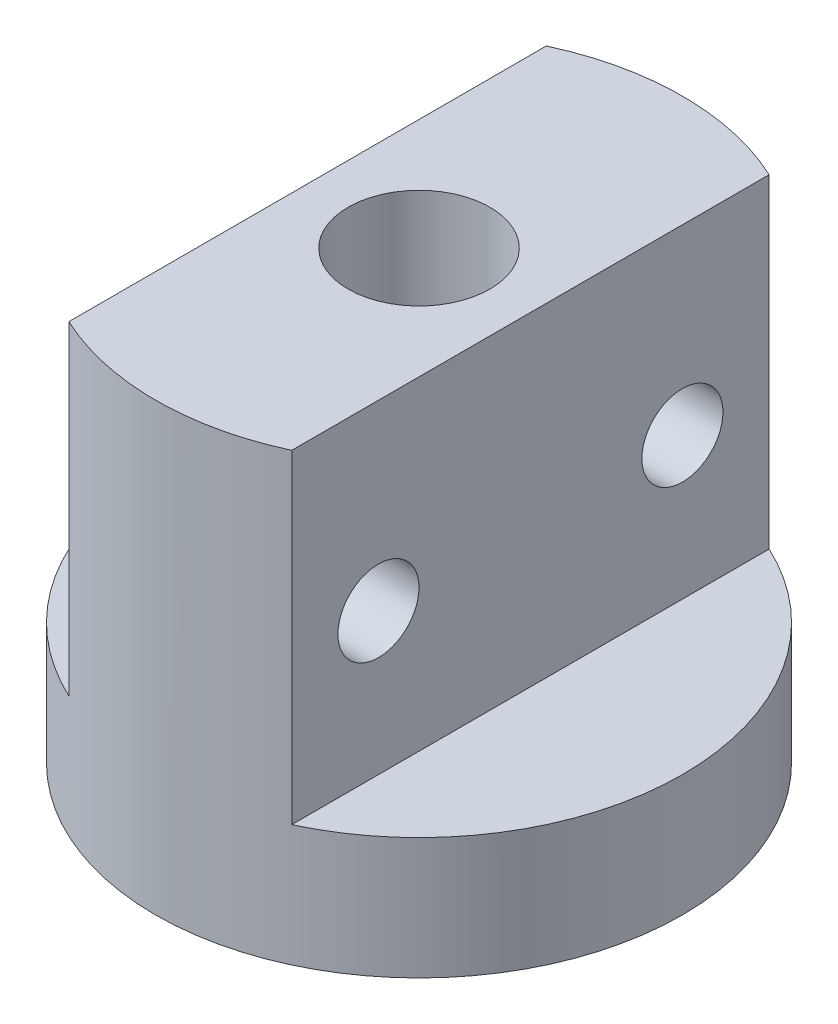
ISO-10303-21;
HEADER;
FILE_DESCRIPTION(('STEP AP214'),'2;1');
FILE_NAME('part.step','',(''),(''),'','','');
FILE_SCHEMA(('AUTOMOTIVE_DESIGN { 1 0 10303 214 1 1 1 1 }'));
ENDSEC;
DATA;
#1=APPLICATION_CONTEXT('core data for automotive mechanical design processes');
#2=APPLICATION_PROTOCOL_DEFINITION('international standard','automotive_design',2000,#1);
#3=PRODUCT_CONTEXT('',#1,'mechanical');
#4=PRODUCT('Part','Part','',(#3));
#5=PRODUCT_RELATED_PRODUCT_CATEGORY('part','',(#4));
#6=PRODUCT_DEFINITION_FORMATION('','',#4);
#7=PRODUCT_DEFINITION_CONTEXT('part definition',#1,'design');
#8=PRODUCT_DEFINITION('design','',#6,#7);
#9=PRODUCT_DEFINITION_SHAPE('','',#8);
#10=(LENGTH_UNIT() NAMED_UNIT(*) SI_UNIT(.MILLI.,.METRE.));
#11=(NAMED_UNIT(*) PLANE_ANGLE_UNIT() SI_UNIT($,.RADIAN.));
#12=(NAMED_UNIT(*) SI_UNIT($,.STERADIAN.) SOLID_ANGLE_UNIT());
#13=UNCERTAINTY_MEASURE_WITH_UNIT(LENGTH_MEASURE(1.E-05),#10,'distance_accuracy_value','');
#14=(GEOMETRIC_REPRESENTATION_CONTEXT(3) GLOBAL_UNCERTAINTY_ASSIGNED_CONTEXT((#13)) GLOBAL_UNIT_ASSIGNED_CONTEXT((#10,
#11,#12)) REPRESENTATION_CONTEXT('',''));
#15=CARTESIAN_POINT('',(0.,0.,0.));
#16=DIRECTION('',(0.,0.,1.));
#17=DIRECTION('',(1.,0.,0.));
#18=AXIS2_PLACEMENT_3D('',#15,#16,#17);
#19=CARTESIAN_POINT('',(0.,22.,0.));
#20=DIRECTION('',(0.,-1.,0.));
#21=DIRECTION('',(0.,0.,-1.));
#22=AXIS2_PLACEMENT_3D('',#19,#20,#21);
#23=CYLINDRICAL_SURFACE('',#22,13.);
#24=CARTESIAN_POINT('',(0.,22.,0.));
#25=DIRECTION('',(0.,1.,0.));
#26=DIRECTION('',(0.,0.,1.));
#27=AXIS2_PLACEMENT_3D('',#24,#25,#26);
#28=CIRCLE('',#27,13.);
#29=CARTESIAN_POINT('',(-5.5,22.,11.7792189893897));
#30=VERTEX_POINT('',#29);
#31=CARTESIAN_POINT('',(5.5,22.,11.7792189893897));
#32=VERTEX_POINT('',#31);
#33=EDGE_CURVE('E92',#30,#32,#28,.T.);
#34=ORIENTED_EDGE('',*,*,#33,.F.);
#35=DIRECTION('',(0.,-1.,0.));
#36=VECTOR('',#35,1.);
#37=CARTESIAN_POINT('',(-5.5,22.,11.7792189893897));
#38=LINE('',#37,#36);
#39=CARTESIAN_POINT('',(-5.5,6.,11.7792189893897));
#40=VERTEX_POINT('',#39);
#41=EDGE_CURVE('E50',#30,#40,#38,.T.);
#42=ORIENTED_EDGE('',*,*,#41,.T.);
#43=CARTESIAN_POINT('',(0.,6.,0.));
#44=DIRECTION('',(0.,-1.,0.));
#45=DIRECTION('',(0.,0.,-1.));
#46=AXIS2_PLACEMENT_3D('',#43,#44,#45);
#47=CIRCLE('',#46,13.);
#48=CARTESIAN_POINT('',(-5.5,6.,-11.7792189893897));
#49=VERTEX_POINT('',#48);
#50=EDGE_CURVE('E11',#40,#49,#47,.T.);
#51=ORIENTED_EDGE('',*,*,#50,.T.);
#52=DIRECTION('',(0.,-1.,0.));
#53=VECTOR('',#52,1.);
#54=CARTESIAN_POINT('',(-5.5,22.,-11.7792189893897));
#55=LINE('',#54,#53);
#56=CARTESIAN_POINT('',(-5.5,22.,-11.7792189893897));
#57=VERTEX_POINT('',#56);
#58=EDGE_CURVE('E77',#49,#57,#55,.F.);
#59=ORIENTED_EDGE('',*,*,#58,.T.);
#60=CARTESIAN_POINT('',(5.5,22.,-11.7792189893897));
#61=VERTEX_POINT('',#60);
#62=EDGE_CURVE('E108',#61,#57,#28,.T.);
#63=ORIENTED_EDGE('',*,*,#62,.F.);
#64=DIRECTION('',(0.,-1.,0.));
#65=VECTOR('',#64,1.);
#66=CARTESIAN_POINT('',(5.5,22.,-11.7792189893897));
#67=LINE('',#66,#65);
#68=CARTESIAN_POINT('',(5.5,6.,-11.7792189893897));
#69=VERTEX_POINT('',#68);
#70=EDGE_CURVE('E58',#61,#69,#67,.T.);
#71=ORIENTED_EDGE('',*,*,#70,.T.);
#72=CARTESIAN_POINT('',(0.,6.,0.));
#73=DIRECTION('',(0.,-1.,0.));
#74=DIRECTION('',(1.,0.,0.));
#75=AXIS2_PLACEMENT_3D('',#72,#73,#74);
#76=CIRCLE('',#75,13.);
#77=CARTESIAN_POINT('',(5.5,6.,11.7792189893897));
#78=VERTEX_POINT('',#77);
#79=EDGE_CURVE('E114',#69,#78,#76,.T.);
#80=ORIENTED_EDGE('',*,*,#79,.T.);
#81=DIRECTION('',(0.,-1.,0.));
#82=VECTOR('',#81,1.);
#83=CARTESIAN_POINT('',(5.5,22.,11.7792189893897));
#84=LINE('',#83,#82);
#85=EDGE_CURVE('E96',#78,#32,#84,.F.);
#86=ORIENTED_EDGE('',*,*,#85,.T.);
#87=EDGE_LOOP('',(#34,#42,#51,#59,#63,#71,#80,#86));
#88=FACE_BOUND('',#87,.T.);
#89=CARTESIAN_POINT('',(0.,0.,0.));
#90=DIRECTION('',(0.,1.,0.));
#91=DIRECTION('',(0.,0.,1.));
#92=AXIS2_PLACEMENT_3D('',#89,#90,#91);
#93=CIRCLE('',#92,13.);
#94=CARTESIAN_POINT('',(0.,0.,13.));
#95=VERTEX_POINT('',#94);
#96=EDGE_CURVE('E105',#95,#95,#93,.T.);
#97=ORIENTED_EDGE('',*,*,#96,.T.);
#98=EDGE_LOOP('',(#97));
#99=FACE_BOUND('',#98,.T.);
#100=ADVANCED_FACE('F34',(#88,#99),#23,.T.);
#101=CARTESIAN_POINT('',(0.,22.,0.));
#102=DIRECTION('',(0.,1.,0.));
#103=DIRECTION('',(0.,0.,1.));
#104=AXIS2_PLACEMENT_3D('',#101,#102,#103);
#105=PLANE('',#104);
#106=CARTESIAN_POINT('',(0.,22.,0.));
#107=DIRECTION('',(0.,1.,0.));
#108=DIRECTION('',(0.,0.,1.));
#109=AXIS2_PLACEMENT_3D('',#106,#107,#108);
#110=CIRCLE('',#109,3.5);
#111=CARTESIAN_POINT('',(0.,22.,3.5));
#112=VERTEX_POINT('',#111);
#113=EDGE_CURVE('E129',#112,#112,#110,.T.);
#114=ORIENTED_EDGE('',*,*,#113,.F.);
#115=EDGE_LOOP('',(#114));
#116=FACE_BOUND('',#115,.T.);
#117=DIRECTION('',(0.,0.,-1.));
#118=VECTOR('',#117,1.);
#119=CARTESIAN_POINT('',(-5.5,22.,0.));
#120=LINE('',#119,#118);
#121=EDGE_CURVE('E42',#30,#57,#120,.T.);
#122=ORIENTED_EDGE('',*,*,#121,.F.);
#123=ORIENTED_EDGE('',*,*,#33,.T.);
#124=DIRECTION('',(0.,0.,1.));
#125=VECTOR('',#124,1.);
#126=CARTESIAN_POINT('',(5.5,22.,0.));
#127=LINE('',#126,#125);
#128=EDGE_CURVE('E110',#61,#32,#127,.T.);
#129=ORIENTED_EDGE('',*,*,#128,.F.);
#130=ORIENTED_EDGE('',*,*,#62,.T.);
#131=EDGE_LOOP('',(#122,#123,#129,#130));
#132=FACE_BOUND('',#131,.T.);
#133=ADVANCED_FACE('F158',(#116,#132),#105,.T.);
#134=CARTESIAN_POINT('',(0.,0.,0.));
#135=DIRECTION('',(0.,1.,0.));
#136=DIRECTION('',(0.,0.,1.));
#137=AXIS2_PLACEMENT_3D('',#134,#135,#136);
#138=PLANE('',#137);
#139=CARTESIAN_POINT('',(0.,0.,0.));
#140=DIRECTION('',(0.,1.,0.));
#141=DIRECTION('',(0.,0.,1.));
#142=AXIS2_PLACEMENT_3D('',#139,#140,#141);
#143=CIRCLE('',#142,7.);
#144=CARTESIAN_POINT('',(0.,0.,7.));
#145=VERTEX_POINT('',#144);
#146=EDGE_CURVE('E101',#145,#145,#143,.T.);
#147=ORIENTED_EDGE('',*,*,#146,.T.);
#148=EDGE_LOOP('',(#147));
#149=FACE_BOUND('',#148,.T.);
#150=ORIENTED_EDGE('',*,*,#96,.F.);
#151=EDGE_LOOP('',(#150));
#152=FACE_BOUND('',#151,.T.);
#153=ADVANCED_FACE('F162',(#149,#152),#138,.F.);
#154=CARTESIAN_POINT('',(0.,5.,0.));
#155=DIRECTION('',(0.,-1.,0.));
#156=DIRECTION('',(0.,0.,-1.));
#157=AXIS2_PLACEMENT_3D('',#154,#155,#156);
#158=CYLINDRICAL_SURFACE('',#157,7.);
#159=CARTESIAN_POINT('',(0.,5.,0.));
#160=DIRECTION('',(0.,1.,0.));
#161=DIRECTION('',(0.,0.,1.));
#162=AXIS2_PLACEMENT_3D('',#159,#160,#161);
#163=CIRCLE('',#162,7.);
#164=CARTESIAN_POINT('',(0.,5.,7.));
#165=VERTEX_POINT('',#164);
#166=EDGE_CURVE('E102',#165,#165,#163,.T.);
#167=ORIENTED_EDGE('',*,*,#166,.T.);
#168=EDGE_LOOP('',(#167));
#169=FACE_BOUND('',#168,.T.);
#170=ORIENTED_EDGE('',*,*,#146,.F.);
#171=EDGE_LOOP('',(#170));
#172=FACE_BOUND('',#171,.T.);
#173=ADVANCED_FACE('F168',(#169,#172),#158,.F.);
#174=CARTESIAN_POINT('',(0.,5.,0.));
#175=DIRECTION('',(0.,1.,0.));
#176=DIRECTION('',(0.,0.,1.));
#177=AXIS2_PLACEMENT_3D('',#174,#175,#176);
#178=PLANE('',#177);
#179=CARTESIAN_POINT('',(0.,5.,0.));
#180=DIRECTION('',(0.,1.,0.));
#181=DIRECTION('',(0.,0.,1.));
#182=AXIS2_PLACEMENT_3D('',#179,#180,#181);
#183=CIRCLE('',#182,1.5);
#184=CARTESIAN_POINT('',(0.,5.,1.5));
#185=VERTEX_POINT('',#184);
#186=EDGE_CURVE('E134',#185,#185,#183,.F.);
#187=ORIENTED_EDGE('',*,*,#186,.F.);
#188=EDGE_LOOP('',(#187));
#189=FACE_BOUND('',#188,.T.);
#190=ORIENTED_EDGE('',*,*,#166,.F.);
#191=EDGE_LOOP('',(#190));
#192=FACE_BOUND('',#191,.T.);
#193=ADVANCED_FACE('F175',(#189,#192),#178,.F.);
#194=CARTESIAN_POINT('',(14.2097179481266,6.,-13.));
#195=DIRECTION('',(0.,-1.,0.));
#196=DIRECTION('',(1.,0.,0.));
#197=AXIS2_PLACEMENT_3D('',#194,#195,#196);
#198=PLANE('',#197);
#199=DIRECTION('',(0.,0.,1.));
#200=VECTOR('',#199,1.);
#201=CARTESIAN_POINT('',(5.5,6.,-13.));
#202=LINE('',#201,#200);
#203=EDGE_CURVE('E93',#69,#78,#202,.T.);
#204=ORIENTED_EDGE('',*,*,#203,.T.);
#205=ORIENTED_EDGE('',*,*,#79,.F.);
#206=EDGE_LOOP('',(#204,#205));
#207=FACE_BOUND('',#206,.T.);
#208=ADVANCED_FACE('F179',(#207),#198,.F.);
#209=CARTESIAN_POINT('',(5.5,23.8611315385121,-13.));
#210=DIRECTION('',(-1.,0.,0.));
#211=DIRECTION('',(0.,-1.,0.));
#212=AXIS2_PLACEMENT_3D('',#209,#210,#211);
#213=PLANE('',#212);
#214=CARTESIAN_POINT('',(5.5,13.,-7.5));
#215=DIRECTION('',(-1.,0.,0.));
#216=DIRECTION('',(0.,-1.,0.));
#217=AXIS2_PLACEMENT_3D('',#214,#215,#216);
#218=CIRCLE('',#217,2.);
#219=CARTESIAN_POINT('',(5.5,11.,-7.5));
#220=VERTEX_POINT('',#219);
#221=EDGE_CURVE('E120',#220,#220,#218,.T.);
#222=ORIENTED_EDGE('',*,*,#221,.T.);
#223=EDGE_LOOP('',(#222));
#224=FACE_BOUND('',#223,.T.);
#225=CARTESIAN_POINT('',(5.5,13.,7.5));
#226=DIRECTION('',(-1.,0.,0.));
#227=DIRECTION('',(0.,-1.,0.));
#228=AXIS2_PLACEMENT_3D('',#225,#226,#227);
#229=CIRCLE('',#228,2.);
#230=CARTESIAN_POINT('',(5.5,11.,7.5));
#231=VERTEX_POINT('',#230);
#232=EDGE_CURVE('E87',#231,#231,#229,.T.);
#233=ORIENTED_EDGE('',*,*,#232,.T.);
#234=EDGE_LOOP('',(#233));
#235=FACE_BOUND('',#234,.T.);
#236=ORIENTED_EDGE('',*,*,#128,.T.);
#237=ORIENTED_EDGE('',*,*,#85,.F.);
#238=ORIENTED_EDGE('',*,*,#203,.F.);
#239=ORIENTED_EDGE('',*,*,#70,.F.);
#240=EDGE_LOOP('',(#236,#237,#238,#239));
#241=FACE_BOUND('',#240,.T.);
#242=ADVANCED_FACE('F141',(#224,#235,#241),#213,.F.);
#243=CARTESIAN_POINT('',(-14.5323328035021,6.,-13.));
#244=DIRECTION('',(0.,-1.,0.));
#245=DIRECTION('',(0.,0.,-1.));
#246=AXIS2_PLACEMENT_3D('',#243,#244,#245);
#247=PLANE('',#246);
#248=DIRECTION('',(0.,0.,1.));
#249=VECTOR('',#248,1.);
#250=CARTESIAN_POINT('',(-5.5,6.,-13.));
#251=LINE('',#250,#249);
#252=EDGE_CURVE('E80',#49,#40,#251,.T.);
#253=ORIENTED_EDGE('',*,*,#252,.F.);
#254=ORIENTED_EDGE('',*,*,#50,.F.);
#255=EDGE_LOOP('',(#253,#254));
#256=FACE_BOUND('',#255,.T.);
#257=ADVANCED_FACE('F86',(#256),#247,.F.);
#258=CARTESIAN_POINT('',(-5.5,23.8024742920802,-13.));
#259=DIRECTION('',(1.,0.,0.));
#260=DIRECTION('',(0.,1.,0.));
#261=AXIS2_PLACEMENT_3D('',#258,#259,#260);
#262=PLANE('',#261);
#263=CARTESIAN_POINT('',(-5.5,13.,-7.5));
#264=DIRECTION('',(1.,0.,0.));
#265=DIRECTION('',(0.,1.,0.));
#266=AXIS2_PLACEMENT_3D('',#263,#264,#265);
#267=CIRCLE('',#266,2.);
#268=CARTESIAN_POINT('',(-5.5,15.,-7.5));
#269=VERTEX_POINT('',#268);
#270=EDGE_CURVE('E121',#269,#269,#267,.T.);
#271=ORIENTED_EDGE('',*,*,#270,.T.);
#272=EDGE_LOOP('',(#271));
#273=FACE_BOUND('',#272,.T.);
#274=CARTESIAN_POINT('',(-5.5,13.,7.5));
#275=DIRECTION('',(1.,0.,0.));
#276=DIRECTION('',(0.,1.,0.));
#277=AXIS2_PLACEMENT_3D('',#274,#275,#276);
#278=CIRCLE('',#277,2.);
#279=CARTESIAN_POINT('',(-5.5,15.,7.5));
#280=VERTEX_POINT('',#279);
#281=EDGE_CURVE('E118',#280,#280,#278,.T.);
#282=ORIENTED_EDGE('',*,*,#281,.T.);
#283=EDGE_LOOP('',(#282));
#284=FACE_BOUND('',#283,.T.);
#285=ORIENTED_EDGE('',*,*,#121,.T.);
#286=ORIENTED_EDGE('',*,*,#58,.F.);
#287=ORIENTED_EDGE('',*,*,#252,.T.);
#288=ORIENTED_EDGE('',*,*,#41,.F.);
#289=EDGE_LOOP('',(#285,#286,#287,#288));
#290=FACE_BOUND('',#289,.T.);
#291=ADVANCED_FACE('F79',(#273,#284,#290),#262,.F.);
#292=CARTESIAN_POINT('',(-13.,13.,7.5));
#293=DIRECTION('',(1.,0.,0.));
#294=DIRECTION('',(0.,0.,-1.));
#295=AXIS2_PLACEMENT_3D('',#292,#293,#294);
#296=CYLINDRICAL_SURFACE('',#295,2.);
#297=ORIENTED_EDGE('',*,*,#281,.F.);
#298=EDGE_LOOP('',(#297));
#299=FACE_BOUND('',#298,.T.);
#300=ORIENTED_EDGE('',*,*,#232,.F.);
#301=EDGE_LOOP('',(#300));
#302=FACE_BOUND('',#301,.T.);
#303=ADVANCED_FACE('F143',(#299,#302),#296,.F.);
#304=CARTESIAN_POINT('',(-13.,13.,-7.5));
#305=DIRECTION('',(1.,0.,0.));
#306=DIRECTION('',(0.,0.,-1.));
#307=AXIS2_PLACEMENT_3D('',#304,#305,#306);
#308=CYLINDRICAL_SURFACE('',#307,2.);
#309=ORIENTED_EDGE('',*,*,#270,.F.);
#310=EDGE_LOOP('',(#309));
#311=FACE_BOUND('',#310,.T.);
#312=ORIENTED_EDGE('',*,*,#221,.F.);
#313=EDGE_LOOP('',(#312));
#314=FACE_BOUND('',#313,.T.);
#315=ADVANCED_FACE('F145',(#311,#314),#308,.F.);
#316=CARTESIAN_POINT('',(0.,17.,0.));
#317=DIRECTION('',(0.,1.,0.));
#318=DIRECTION('',(0.,0.,1.));
#319=AXIS2_PLACEMENT_3D('',#316,#317,#318);
#320=CYLINDRICAL_SURFACE('',#319,3.5);
#321=CARTESIAN_POINT('',(0.,17.,0.));
#322=DIRECTION('',(0.,1.,0.));
#323=DIRECTION('',(0.,0.,1.));
#324=AXIS2_PLACEMENT_3D('',#321,#322,#323);
#325=CIRCLE('',#324,3.5);
#326=CARTESIAN_POINT('',(0.,17.,3.5));
#327=VERTEX_POINT('',#326);
#328=EDGE_CURVE('E123',#327,#327,#325,.T.);
#329=ORIENTED_EDGE('',*,*,#328,.F.);
#330=EDGE_LOOP('',(#329));
#331=FACE_BOUND('',#330,.T.);
#332=ORIENTED_EDGE('',*,*,#113,.T.);
#333=EDGE_LOOP('',(#332));
#334=FACE_BOUND('',#333,.T.);
#335=ADVANCED_FACE('F152',(#331,#334),#320,.F.);
#336=CARTESIAN_POINT('',(0.,17.,0.));
#337=DIRECTION('',(0.,1.,0.));
#338=DIRECTION('',(0.,0.,1.));
#339=AXIS2_PLACEMENT_3D('',#336,#337,#338);
#340=PLANE('',#339);
#341=CARTESIAN_POINT('',(0.,17.,0.));
#342=DIRECTION('',(0.,1.,0.));
#343=DIRECTION('',(0.,0.,1.));
#344=AXIS2_PLACEMENT_3D('',#341,#342,#343);
#345=CIRCLE('',#344,1.5);
#346=CARTESIAN_POINT('',(0.,17.,1.5));
#347=VERTEX_POINT('',#346);
#348=EDGE_CURVE('E37',#347,#347,#345,.F.);
#349=ORIENTED_EDGE('',*,*,#348,.T.);
#350=EDGE_LOOP('',(#349));
#351=FACE_BOUND('',#350,.T.);
#352=ORIENTED_EDGE('',*,*,#328,.T.);
#353=EDGE_LOOP('',(#352));
#354=FACE_BOUND('',#353,.T.);
#355=ADVANCED_FACE('F224',(#351,#354),#340,.T.);
#356=CARTESIAN_POINT('',(0.,22.,0.));
#357=DIRECTION('',(0.,-1.,0.));
#358=DIRECTION('',(0.,0.,-1.));
#359=AXIS2_PLACEMENT_3D('',#356,#357,#358);
#360=CYLINDRICAL_SURFACE('',#359,1.5);
#361=ORIENTED_EDGE('',*,*,#348,.F.);
#362=EDGE_LOOP('',(#361));
#363=FACE_BOUND('',#362,.T.);
#364=ORIENTED_EDGE('',*,*,#186,.T.);
#365=EDGE_LOOP('',(#364));
#366=FACE_BOUND('',#365,.T.);
#367=ADVANCED_FACE('F242',(#363,#366),#360,.F.);
#368=CLOSED_SHELL('',(#100,#133,#153,#173,#193,#208,#242,#257,#291,#303,#315,#335,#355,#367));
#369=MANIFOLD_SOLID_BREP('B2',#368);
#370=ADVANCED_BREP_SHAPE_REPRESENTATION('',(#18,#369),#14);
#371=SHAPE_DEFINITION_REPRESENTATION(#9,#370);
ENDSEC;
END-ISO-10303-21;
